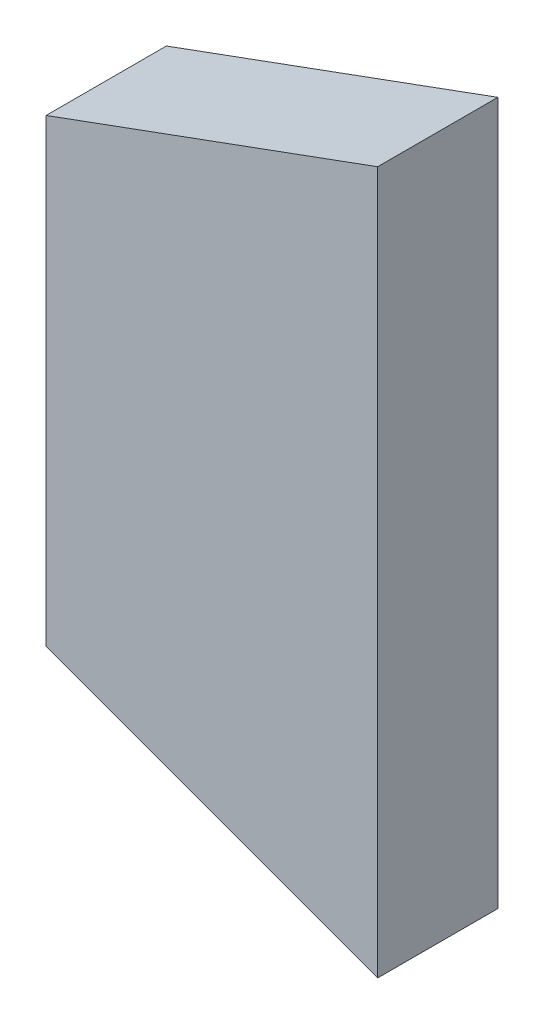
ISO-10303-21;
HEADER;
FILE_DESCRIPTION(('STEP AP214'),'2;1');
FILE_NAME('part.step','',(''),(''),'','','');
FILE_SCHEMA(('AUTOMOTIVE_DESIGN { 1 0 10303 214 1 1 1 1 }'));
ENDSEC;
DATA;
#1=APPLICATION_CONTEXT('core data for automotive mechanical design processes');
#2=APPLICATION_PROTOCOL_DEFINITION('international standard','automotive_design',2000,#1);
#3=PRODUCT_CONTEXT('',#1,'mechanical');
#4=PRODUCT('Part','Part','',(#3));
#5=PRODUCT_RELATED_PRODUCT_CATEGORY('part','',(#4));
#6=PRODUCT_DEFINITION_FORMATION('','',#4);
#7=PRODUCT_DEFINITION_CONTEXT('part definition',#1,'design');
#8=PRODUCT_DEFINITION('design','',#6,#7);
#9=PRODUCT_DEFINITION_SHAPE('','',#8);
#10=(LENGTH_UNIT() NAMED_UNIT(*) SI_UNIT(.MILLI.,.METRE.));
#11=(NAMED_UNIT(*) PLANE_ANGLE_UNIT() SI_UNIT($,.RADIAN.));
#12=(NAMED_UNIT(*) SI_UNIT($,.STERADIAN.) SOLID_ANGLE_UNIT());
#13=UNCERTAINTY_MEASURE_WITH_UNIT(LENGTH_MEASURE(1.E-05),#10,'distance_accuracy_value','');
#14=(GEOMETRIC_REPRESENTATION_CONTEXT(3) GLOBAL_UNCERTAINTY_ASSIGNED_CONTEXT((#13)) GLOBAL_UNIT_ASSIGNED_CONTEXT((#10,
#11,#12)) REPRESENTATION_CONTEXT('',''));
#15=CARTESIAN_POINT('',(0.,0.,0.));
#16=DIRECTION('',(0.,0.,1.));
#17=DIRECTION('',(1.,0.,0.));
#18=AXIS2_PLACEMENT_3D('',#15,#16,#17);
#19=CARTESIAN_POINT('',(0.00496781732412722,-1.39163983521276,0.));
#20=DIRECTION('',(-0.343666815097042,-0.939091646326947,0.));
#21=DIRECTION('',(0.939091646326947,-0.343666815097042,0.));
#22=AXIS2_PLACEMENT_3D('',#19,#20,#21);
#23=PLANE('',#22);
#24=DIRECTION('',(0.939091646326947,-0.343666815097042,0.));
#25=VECTOR('',#24,1.);
#26=CARTESIAN_POINT('',(0.00496781732412722,-1.39163983521276,0.));
#27=LINE('',#26,#25);
#28=CARTESIAN_POINT('',(0.00496781732412722,-1.39163983521276,0.));
#29=VERTEX_POINT('',#28);
#30=CARTESIAN_POINT('',(0.28066634578022,-1.49253353986026,0.));
#31=VERTEX_POINT('',#30);
#32=EDGE_CURVE('E11',#29,#31,#27,.T.);
#33=ORIENTED_EDGE('',*,*,#32,.T.);
#34=DIRECTION('',(0.,0.,1.));
#35=VECTOR('',#34,1.);
#36=CARTESIAN_POINT('',(0.28066634578022,-1.49253353986026,0.));
#37=LINE('',#36,#35);
#38=CARTESIAN_POINT('',(0.28066634578022,-1.49253353986026,0.1));
#39=VERTEX_POINT('',#38);
#40=EDGE_CURVE('E88',#31,#39,#37,.T.);
#41=ORIENTED_EDGE('',*,*,#40,.T.);
#42=DIRECTION('',(0.939091646326947,-0.343666815097042,0.));
#43=VECTOR('',#42,1.);
#44=CARTESIAN_POINT('',(0.00496781732412722,-1.39163983521276,0.1));
#45=LINE('',#44,#43);
#46=CARTESIAN_POINT('',(0.00496781732412722,-1.39163983521276,0.1));
#47=VERTEX_POINT('',#46);
#48=EDGE_CURVE('E63',#47,#39,#45,.T.);
#49=ORIENTED_EDGE('',*,*,#48,.F.);
#50=DIRECTION('',(0.,0.,1.));
#51=VECTOR('',#50,1.);
#52=CARTESIAN_POINT('',(0.00496781732412722,-1.39163983521276,0.));
#53=LINE('',#52,#51);
#54=EDGE_CURVE('E84',#29,#47,#53,.T.);
#55=ORIENTED_EDGE('',*,*,#54,.F.);
#56=EDGE_LOOP('',(#33,#41,#49,#55));
#57=FACE_BOUND('',#56,.T.);
#58=ADVANCED_FACE('F17',(#57),#23,.T.);
#59=CARTESIAN_POINT('',(0.00496781732412833,-1.00915701695165,0.));
#60=DIRECTION('',(-1.,0.,0.));
#61=DIRECTION('',(0.,-1.,0.));
#62=AXIS2_PLACEMENT_3D('',#59,#60,#61);
#63=PLANE('',#62);
#64=DIRECTION('',(0.,-1.,0.));
#65=VECTOR('',#64,1.);
#66=CARTESIAN_POINT('',(0.00496781732412833,-1.00915701695165,0.));
#67=LINE('',#66,#65);
#68=CARTESIAN_POINT('',(0.00496781732412833,-1.00915701695165,0.));
#69=VERTEX_POINT('',#68);
#70=EDGE_CURVE('E24',#69,#29,#67,.T.);
#71=ORIENTED_EDGE('',*,*,#70,.T.);
#72=ORIENTED_EDGE('',*,*,#54,.T.);
#73=DIRECTION('',(0.,-1.,0.));
#74=VECTOR('',#73,1.);
#75=CARTESIAN_POINT('',(0.00496781732412833,-1.00915701695165,0.1));
#76=LINE('',#75,#74);
#77=CARTESIAN_POINT('',(0.00496781732412833,-1.00915701695165,0.1));
#78=VERTEX_POINT('',#77);
#79=EDGE_CURVE('E66',#78,#47,#76,.T.);
#80=ORIENTED_EDGE('',*,*,#79,.F.);
#81=DIRECTION('',(0.,0.,1.));
#82=VECTOR('',#81,1.);
#83=CARTESIAN_POINT('',(0.00496781732412833,-1.00915701695165,0.));
#84=LINE('',#83,#82);
#85=EDGE_CURVE('E76',#69,#78,#84,.T.);
#86=ORIENTED_EDGE('',*,*,#85,.F.);
#87=EDGE_LOOP('',(#71,#72,#80,#86));
#88=FACE_BOUND('',#87,.T.);
#89=ADVANCED_FACE('F89',(#88),#63,.T.);
#90=CARTESIAN_POINT('',(0.28066634578022,-0.908263312304153,0.));
#91=DIRECTION('',(-0.343666815097042,0.939091646326947,0.));
#92=DIRECTION('',(-0.939091646326947,-0.343666815097042,0.));
#93=AXIS2_PLACEMENT_3D('',#90,#91,#92);
#94=PLANE('',#93);
#95=DIRECTION('',(-0.939091646326947,-0.343666815097042,0.));
#96=VECTOR('',#95,1.);
#97=CARTESIAN_POINT('',(0.28066634578022,-0.908263312304153,0.));
#98=LINE('',#97,#96);
#99=CARTESIAN_POINT('',(0.28066634578022,-0.908263312304153,0.));
#100=VERTEX_POINT('',#99);
#101=EDGE_CURVE('E86',#100,#69,#98,.T.);
#102=ORIENTED_EDGE('',*,*,#101,.T.);
#103=ORIENTED_EDGE('',*,*,#85,.T.);
#104=DIRECTION('',(-0.939091646326947,-0.343666815097042,0.));
#105=VECTOR('',#104,1.);
#106=CARTESIAN_POINT('',(0.28066634578022,-0.908263312304153,0.1));
#107=LINE('',#106,#105);
#108=CARTESIAN_POINT('',(0.28066634578022,-0.908263312304153,0.1));
#109=VERTEX_POINT('',#108);
#110=EDGE_CURVE('E61',#109,#78,#107,.T.);
#111=ORIENTED_EDGE('',*,*,#110,.F.);
#112=DIRECTION('',(0.,0.,1.));
#113=VECTOR('',#112,1.);
#114=CARTESIAN_POINT('',(0.28066634578022,-0.908263312304153,0.));
#115=LINE('',#114,#113);
#116=EDGE_CURVE('E67',#100,#109,#115,.T.);
#117=ORIENTED_EDGE('',*,*,#116,.F.);
#118=EDGE_LOOP('',(#102,#103,#111,#117));
#119=FACE_BOUND('',#118,.T.);
#120=ADVANCED_FACE('F75',(#119),#94,.T.);
#121=CARTESIAN_POINT('',(0.28066634578022,-1.49253353986026,0.));
#122=DIRECTION('',(1.,0.,0.));
#123=DIRECTION('',(0.,1.,0.));
#124=AXIS2_PLACEMENT_3D('',#121,#122,#123);
#125=PLANE('',#124);
#126=DIRECTION('',(0.,1.,0.));
#127=VECTOR('',#126,1.);
#128=CARTESIAN_POINT('',(0.28066634578022,-1.49253353986026,0.));
#129=LINE('',#128,#127);
#130=EDGE_CURVE('E71',#31,#100,#129,.T.);
#131=ORIENTED_EDGE('',*,*,#130,.T.);
#132=ORIENTED_EDGE('',*,*,#116,.T.);
#133=DIRECTION('',(0.,1.,0.));
#134=VECTOR('',#133,1.);
#135=CARTESIAN_POINT('',(0.28066634578022,-1.49253353986026,0.1));
#136=LINE('',#135,#134);
#137=EDGE_CURVE('E56',#39,#109,#136,.T.);
#138=ORIENTED_EDGE('',*,*,#137,.F.);
#139=ORIENTED_EDGE('',*,*,#40,.F.);
#140=EDGE_LOOP('',(#131,#132,#138,#139));
#141=FACE_BOUND('',#140,.T.);
#142=ADVANCED_FACE('F70',(#141),#125,.T.);
#143=CARTESIAN_POINT('',(0.160717855257029,-1.20039842608221,0.1));
#144=DIRECTION('',(0.,0.,1.));
#145=DIRECTION('',(1.,0.,0.));
#146=AXIS2_PLACEMENT_3D('',#143,#144,#145);
#147=PLANE('',#146);
#148=ORIENTED_EDGE('',*,*,#137,.T.);
#149=ORIENTED_EDGE('',*,*,#110,.T.);
#150=ORIENTED_EDGE('',*,*,#79,.T.);
#151=ORIENTED_EDGE('',*,*,#48,.T.);
#152=EDGE_LOOP('',(#148,#149,#150,#151));
#153=FACE_BOUND('',#152,.T.);
#154=ADVANCED_FACE('F58',(#153),#147,.T.);
#155=CARTESIAN_POINT('',(0.160717855257029,-1.20039842608221,0.));
#156=DIRECTION('',(0.,0.,1.));
#157=DIRECTION('',(1.,0.,0.));
#158=AXIS2_PLACEMENT_3D('',#155,#156,#157);
#159=PLANE('',#158);
#160=ORIENTED_EDGE('',*,*,#130,.F.);
#161=ORIENTED_EDGE('',*,*,#32,.F.);
#162=ORIENTED_EDGE('',*,*,#70,.F.);
#163=ORIENTED_EDGE('',*,*,#101,.F.);
#164=EDGE_LOOP('',(#160,#161,#162,#163));
#165=FACE_BOUND('',#164,.T.);
#166=ADVANCED_FACE('F91',(#165),#159,.F.);
#167=CLOSED_SHELL('',(#58,#89,#120,#142,#154,#166));
#168=MANIFOLD_SOLID_BREP('B1',#167);
#169=ADVANCED_BREP_SHAPE_REPRESENTATION('',(#18,#168),#14);
#170=SHAPE_DEFINITION_REPRESENTATION(#9,#169);
ENDSEC;
END-ISO-10303-21;
